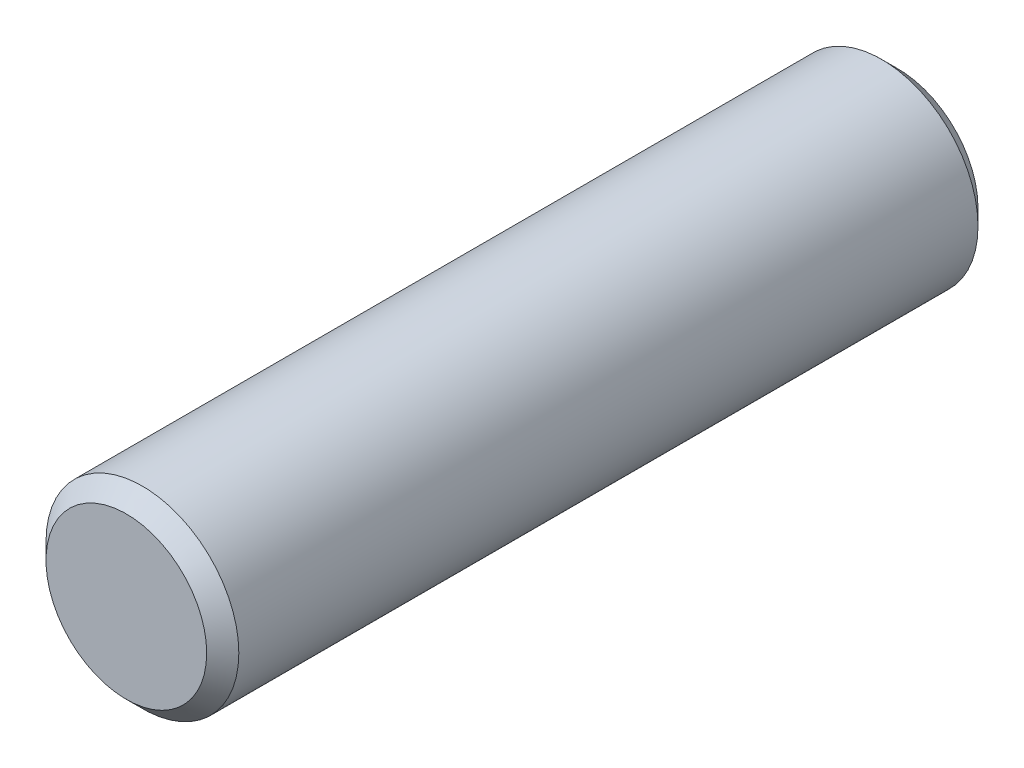
ISO-10303-21;
HEADER;
FILE_DESCRIPTION(('STEP AP214'),'2;1');
FILE_NAME('part.step','',(''),(''),'','','');
FILE_SCHEMA(('AUTOMOTIVE_DESIGN { 1 0 10303 214 1 1 1 1 }'));
ENDSEC;
DATA;
#1=APPLICATION_CONTEXT('core data for automotive mechanical design processes');
#2=APPLICATION_PROTOCOL_DEFINITION('international standard','automotive_design',2000,#1);
#3=PRODUCT_CONTEXT('',#1,'mechanical');
#4=PRODUCT('Part','Part','',(#3));
#5=PRODUCT_RELATED_PRODUCT_CATEGORY('part','',(#4));
#6=PRODUCT_DEFINITION_FORMATION('','',#4);
#7=PRODUCT_DEFINITION_CONTEXT('part definition',#1,'design');
#8=PRODUCT_DEFINITION('design','',#6,#7);
#9=PRODUCT_DEFINITION_SHAPE('','',#8);
#10=(LENGTH_UNIT() NAMED_UNIT(*) SI_UNIT(.MILLI.,.METRE.));
#11=(NAMED_UNIT(*) PLANE_ANGLE_UNIT() SI_UNIT($,.RADIAN.));
#12=(NAMED_UNIT(*) SI_UNIT($,.STERADIAN.) SOLID_ANGLE_UNIT());
#13=UNCERTAINTY_MEASURE_WITH_UNIT(LENGTH_MEASURE(1.E-05),#10,'distance_accuracy_value','');
#14=(GEOMETRIC_REPRESENTATION_CONTEXT(3) GLOBAL_UNCERTAINTY_ASSIGNED_CONTEXT((#13)) GLOBAL_UNIT_ASSIGNED_CONTEXT((#10,
#11,#12)) REPRESENTATION_CONTEXT('',''));
#15=CARTESIAN_POINT('',(0.,0.,0.));
#16=DIRECTION('',(0.,0.,1.));
#17=DIRECTION('',(1.,0.,0.));
#18=AXIS2_PLACEMENT_3D('',#15,#16,#17);
#19=CARTESIAN_POINT('',(0.,0.,24.));
#20=DIRECTION('',(0.,0.,-1.));
#21=DIRECTION('',(-0.999999999999999,0.,0.));
#22=AXIS2_PLACEMENT_3D('',#19,#20,#21);
#23=CYLINDRICAL_SURFACE('',#22,3.);
#24=CARTESIAN_POINT('',(0.,0.,23.4999999999999));
#25=DIRECTION('',(0.,0.,1.));
#26=DIRECTION('',(0.999999999999999,0.,0.));
#27=AXIS2_PLACEMENT_3D('',#24,#25,#26);
#28=CIRCLE('',#27,3.);
#29=CARTESIAN_POINT('',(3.,0.,23.4999999999999));
#30=VERTEX_POINT('',#29);
#31=EDGE_CURVE('E36',#30,#30,#28,.F.);
#32=ORIENTED_EDGE('',*,*,#31,.T.);
#33=EDGE_LOOP('',(#32));
#34=FACE_BOUND('',#33,.T.);
#35=CARTESIAN_POINT('',(0.,0.,0.500000000000007));
#36=DIRECTION('',(0.,0.,1.));
#37=DIRECTION('',(0.999999999999999,0.,0.));
#38=AXIS2_PLACEMENT_3D('',#35,#36,#37);
#39=CIRCLE('',#38,3.);
#40=CARTESIAN_POINT('',(3.,0.,0.500000000000007));
#41=VERTEX_POINT('',#40);
#42=EDGE_CURVE('E40',#41,#41,#39,.T.);
#43=ORIENTED_EDGE('',*,*,#42,.T.);
#44=EDGE_LOOP('',(#43));
#45=FACE_BOUND('',#44,.T.);
#46=ADVANCED_FACE('F30',(#34,#45),#23,.T.);
#47=CARTESIAN_POINT('',(0.,0.,24.));
#48=DIRECTION('',(0.,0.,1.));
#49=DIRECTION('',(0.999999999999999,0.,0.));
#50=AXIS2_PLACEMENT_3D('',#47,#48,#49);
#51=PLANE('',#50);
#52=CARTESIAN_POINT('',(0.,0.,24.));
#53=DIRECTION('',(0.,0.,1.));
#54=DIRECTION('',(0.999999999999999,0.,0.));
#55=AXIS2_PLACEMENT_3D('',#52,#53,#54);
#56=CIRCLE('',#55,2.5);
#57=CARTESIAN_POINT('',(2.49999999999999,0.,24.));
#58=VERTEX_POINT('',#57);
#59=EDGE_CURVE('E44',#58,#58,#56,.T.);
#60=ORIENTED_EDGE('',*,*,#59,.T.);
#61=EDGE_LOOP('',(#60));
#62=FACE_BOUND('',#61,.T.);
#63=ADVANCED_FACE('F50',(#62),#51,.T.);
#64=CARTESIAN_POINT('',(0.,0.,0.));
#65=DIRECTION('',(0.,0.,1.));
#66=DIRECTION('',(0.999999999999999,0.,0.));
#67=AXIS2_PLACEMENT_3D('',#64,#65,#66);
#68=PLANE('',#67);
#69=CARTESIAN_POINT('',(0.,0.,0.));
#70=DIRECTION('',(0.,0.,1.));
#71=DIRECTION('',(0.999999999999999,0.,0.));
#72=AXIS2_PLACEMENT_3D('',#69,#70,#71);
#73=CIRCLE('',#72,2.5);
#74=CARTESIAN_POINT('',(2.49999999999999,0.,0.));
#75=VERTEX_POINT('',#74);
#76=EDGE_CURVE('E10',#75,#75,#73,.F.);
#77=ORIENTED_EDGE('',*,*,#76,.T.);
#78=EDGE_LOOP('',(#77));
#79=FACE_BOUND('',#78,.T.);
#80=ADVANCED_FACE('F55',(#79),#68,.F.);
#81=CARTESIAN_POINT('',(0.,0.,24.));
#82=DIRECTION('',(0.,0.,-1.));
#83=DIRECTION('',(-0.999999999999999,0.,0.));
#84=AXIS2_PLACEMENT_3D('',#81,#82,#83);
#85=CONICAL_SURFACE('',#84,2.5,0.785398163397445);
#86=ORIENTED_EDGE('',*,*,#31,.F.);
#87=EDGE_LOOP('',(#86));
#88=FACE_BOUND('',#87,.T.);
#89=ORIENTED_EDGE('',*,*,#59,.F.);
#90=EDGE_LOOP('',(#89));
#91=FACE_BOUND('',#90,.T.);
#92=ADVANCED_FACE('F52',(#88,#91),#85,.T.);
#93=CARTESIAN_POINT('',(0.,0.,0.500000000000007));
#94=DIRECTION('',(0.,0.,1.));
#95=DIRECTION('',(0.999999999999999,0.,0.));
#96=AXIS2_PLACEMENT_3D('',#93,#94,#95);
#97=CONICAL_SURFACE('',#96,3.,0.785398163397443);
#98=ORIENTED_EDGE('',*,*,#76,.F.);
#99=EDGE_LOOP('',(#98));
#100=FACE_BOUND('',#99,.T.);
#101=ORIENTED_EDGE('',*,*,#42,.F.);
#102=EDGE_LOOP('',(#101));
#103=FACE_BOUND('',#102,.T.);
#104=ADVANCED_FACE('F54',(#100,#103),#97,.T.);
#105=CLOSED_SHELL('',(#46,#63,#80,#92,#104));
#106=MANIFOLD_SOLID_BREP('B2',#105);
#107=ADVANCED_BREP_SHAPE_REPRESENTATION('',(#18,#106),#14);
#108=SHAPE_DEFINITION_REPRESENTATION(#9,#107);
ENDSEC;
END-ISO-10303-21;
